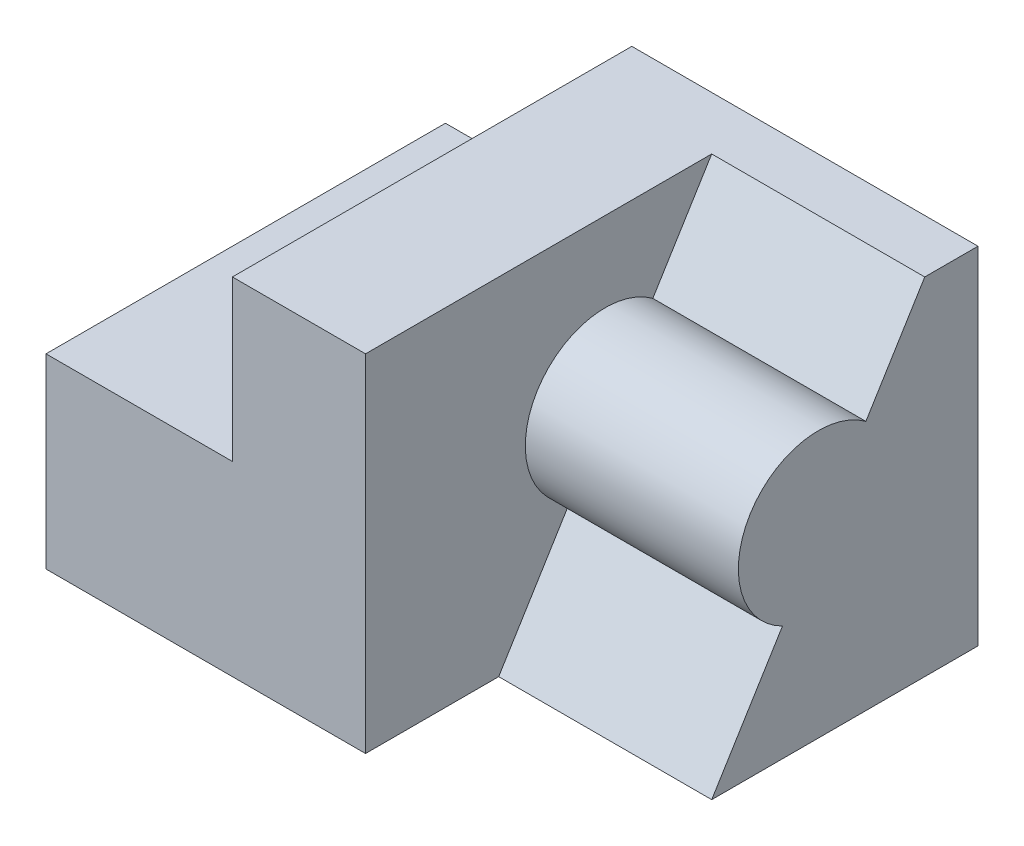
ISO-10303-21;
HEADER;
FILE_DESCRIPTION(('STEP AP214'),'2;1');
FILE_NAME('part.step','',(''),(''),'','','');
FILE_SCHEMA(('AUTOMOTIVE_DESIGN { 1 0 10303 214 1 1 1 1 }'));
ENDSEC;
DATA;
#1=APPLICATION_CONTEXT('core data for automotive mechanical design processes');
#2=APPLICATION_PROTOCOL_DEFINITION('international standard','automotive_design',2000,#1);
#3=PRODUCT_CONTEXT('',#1,'mechanical');
#4=PRODUCT('Part','Part','',(#3));
#5=PRODUCT_RELATED_PRODUCT_CATEGORY('part','',(#4));
#6=PRODUCT_DEFINITION_FORMATION('','',#4);
#7=PRODUCT_DEFINITION_CONTEXT('part definition',#1,'design');
#8=PRODUCT_DEFINITION('design','',#6,#7);
#9=PRODUCT_DEFINITION_SHAPE('','',#8);
#10=(LENGTH_UNIT() NAMED_UNIT(*) SI_UNIT(.MILLI.,.METRE.));
#11=(NAMED_UNIT(*) PLANE_ANGLE_UNIT() SI_UNIT($,.RADIAN.));
#12=(NAMED_UNIT(*) SI_UNIT($,.STERADIAN.) SOLID_ANGLE_UNIT());
#13=UNCERTAINTY_MEASURE_WITH_UNIT(LENGTH_MEASURE(1.E-05),#10,'distance_accuracy_value','');
#14=(GEOMETRIC_REPRESENTATION_CONTEXT(3) GLOBAL_UNCERTAINTY_ASSIGNED_CONTEXT((#13)) GLOBAL_UNIT_ASSIGNED_CONTEXT((#10,
#11,#12)) REPRESENTATION_CONTEXT('',''));
#15=CARTESIAN_POINT('',(0.,0.,0.));
#16=DIRECTION('',(0.,0.,1.));
#17=DIRECTION('',(1.,0.,0.));
#18=AXIS2_PLACEMENT_3D('',#15,#16,#17);
#19=CARTESIAN_POINT('',(0.,65.,0.));
#20=DIRECTION('',(0.,0.,-1.));
#21=DIRECTION('',(-1.,0.,0.));
#22=AXIS2_PLACEMENT_3D('',#19,#20,#21);
#23=PLANE('',#22);
#24=DIRECTION('',(0.,-1.,0.));
#25=VECTOR('',#24,1.);
#26=CARTESIAN_POINT('',(60.,65.,0.));
#27=LINE('',#26,#25);
#28=CARTESIAN_POINT('',(60.,65.,0.));
#29=VERTEX_POINT('',#28);
#30=CARTESIAN_POINT('',(60.,0.,0.));
#31=VERTEX_POINT('',#30);
#32=EDGE_CURVE('E54',#29,#31,#27,.T.);
#33=ORIENTED_EDGE('',*,*,#32,.F.);
#34=DIRECTION('',(1.,0.,0.));
#35=VECTOR('',#34,1.);
#36=CARTESIAN_POINT('',(0.,65.,0.));
#37=LINE('',#36,#35);
#38=CARTESIAN_POINT('',(35.,65.,0.));
#39=VERTEX_POINT('',#38);
#40=EDGE_CURVE('E162',#39,#29,#37,.T.);
#41=ORIENTED_EDGE('',*,*,#40,.F.);
#42=DIRECTION('',(0.,1.,0.));
#43=VECTOR('',#42,1.);
#44=CARTESIAN_POINT('',(35.,35.,0.));
#45=LINE('',#44,#43);
#46=CARTESIAN_POINT('',(35.,35.,0.));
#47=VERTEX_POINT('',#46);
#48=EDGE_CURVE('E62',#47,#39,#45,.T.);
#49=ORIENTED_EDGE('',*,*,#48,.F.);
#50=DIRECTION('',(1.,0.,0.));
#51=VECTOR('',#50,1.);
#52=CARTESIAN_POINT('',(0.,35.,0.));
#53=LINE('',#52,#51);
#54=CARTESIAN_POINT('',(0.,35.,0.));
#55=VERTEX_POINT('',#54);
#56=EDGE_CURVE('E146',#55,#47,#53,.T.);
#57=ORIENTED_EDGE('',*,*,#56,.F.);
#58=DIRECTION('',(0.,-1.,0.));
#59=VECTOR('',#58,1.);
#60=CARTESIAN_POINT('',(0.,65.,0.));
#61=LINE('',#60,#59);
#62=CARTESIAN_POINT('',(0.,0.,0.));
#63=VERTEX_POINT('',#62);
#64=EDGE_CURVE('E11',#55,#63,#61,.T.);
#65=ORIENTED_EDGE('',*,*,#64,.T.);
#66=DIRECTION('',(1.,0.,0.));
#67=VECTOR('',#66,1.);
#68=CARTESIAN_POINT('',(0.,0.,0.));
#69=LINE('',#68,#67);
#70=EDGE_CURVE('E174',#63,#31,#69,.T.);
#71=ORIENTED_EDGE('',*,*,#70,.T.);
#72=EDGE_LOOP('',(#33,#41,#49,#57,#65,#71));
#73=FACE_BOUND('',#72,.T.);
#74=ADVANCED_FACE('F39',(#73),#23,.F.);
#75=CARTESIAN_POINT('',(0.,65.,0.));
#76=DIRECTION('',(1.,0.,0.));
#77=DIRECTION('',(0.,0.,-1.));
#78=AXIS2_PLACEMENT_3D('',#75,#76,#77);
#79=PLANE('',#78);
#80=ORIENTED_EDGE('',*,*,#64,.F.);
#81=DIRECTION('',(0.,0.,1.));
#82=VECTOR('',#81,1.);
#83=CARTESIAN_POINT('',(0.,35.,0.));
#84=LINE('',#83,#82);
#85=CARTESIAN_POINT('',(0.,35.,-75.));
#86=VERTEX_POINT('',#85);
#87=EDGE_CURVE('E144',#86,#55,#84,.T.);
#88=ORIENTED_EDGE('',*,*,#87,.F.);
#89=DIRECTION('',(0.,-1.,0.));
#90=VECTOR('',#89,1.);
#91=CARTESIAN_POINT('',(0.,65.,-75.));
#92=LINE('',#91,#90);
#93=CARTESIAN_POINT('',(0.,0.,-75.));
#94=VERTEX_POINT('',#93);
#95=EDGE_CURVE('E171',#86,#94,#92,.T.);
#96=ORIENTED_EDGE('',*,*,#95,.T.);
#97=DIRECTION('',(0.,0.,1.));
#98=VECTOR('',#97,1.);
#99=CARTESIAN_POINT('',(0.,0.,0.));
#100=LINE('',#99,#98);
#101=EDGE_CURVE('E160',#94,#63,#100,.T.);
#102=ORIENTED_EDGE('',*,*,#101,.T.);
#103=EDGE_LOOP('',(#80,#88,#96,#102));
#104=FACE_BOUND('',#103,.T.);
#105=ADVANCED_FACE('F41',(#104),#79,.F.);
#106=CARTESIAN_POINT('',(100.,65.,0.));
#107=DIRECTION('',(-1.,0.,0.));
#108=DIRECTION('',(0.,0.,1.));
#109=AXIS2_PLACEMENT_3D('',#106,#107,#108);
#110=PLANE('',#109);
#111=DIRECTION('',(0.,0.,-1.));
#112=VECTOR('',#111,1.);
#113=CARTESIAN_POINT('',(100.,65.,0.));
#114=LINE('',#113,#112);
#115=CARTESIAN_POINT('',(100.,65.,-65.));
#116=VERTEX_POINT('',#115);
#117=CARTESIAN_POINT('',(100.,65.,-75.));
#118=VERTEX_POINT('',#117);
#119=EDGE_CURVE('E165',#116,#118,#114,.T.);
#120=ORIENTED_EDGE('',*,*,#119,.F.);
#121=DIRECTION('',(0.,0.851658316704544,-0.524097425664335));
#122=VECTOR('',#121,1.);
#123=CARTESIAN_POINT('',(100.,47.0393503402096,-53.947292517052));
#124=LINE('',#123,#122);
#125=CARTESIAN_POINT('',(100.,47.0393503402096,-53.947292517052));
#126=VERTEX_POINT('',#125);
#127=EDGE_CURVE('E131',#126,#116,#124,.T.);
#128=ORIENTED_EDGE('',*,*,#127,.F.);
#129=CARTESIAN_POINT('',(100.,35.,-45.));
#130=DIRECTION('',(-1.,0.,0.));
#131=DIRECTION('',(0.,0.,-1.));
#132=AXIS2_PLACEMENT_3D('',#129,#130,#131);
#133=CIRCLE('',#132,15.);
#134=CARTESIAN_POINT('',(100.,21.5872591018505,-38.2844671396003));
#135=VERTEX_POINT('',#134);
#136=EDGE_CURVE('E330',#135,#126,#133,.T.);
#137=ORIENTED_EDGE('',*,*,#136,.F.);
#138=DIRECTION('',(0.,0.851658316704544,-0.524097425664335));
#139=VECTOR('',#138,1.);
#140=CARTESIAN_POINT('',(100.,0.,-25.));
#141=LINE('',#140,#139);
#142=CARTESIAN_POINT('',(100.,0.,-25.));
#143=VERTEX_POINT('',#142);
#144=EDGE_CURVE('E335',#143,#135,#141,.T.);
#145=ORIENTED_EDGE('',*,*,#144,.F.);
#146=DIRECTION('',(0.,0.,-1.));
#147=VECTOR('',#146,1.);
#148=CARTESIAN_POINT('',(100.,0.,0.));
#149=LINE('',#148,#147);
#150=CARTESIAN_POINT('',(100.,0.,-75.));
#151=VERTEX_POINT('',#150);
#152=EDGE_CURVE('E136',#143,#151,#149,.T.);
#153=ORIENTED_EDGE('',*,*,#152,.T.);
#154=DIRECTION('',(0.,-1.,0.));
#155=VECTOR('',#154,1.);
#156=CARTESIAN_POINT('',(100.,65.,-75.));
#157=LINE('',#156,#155);
#158=EDGE_CURVE('E47',#118,#151,#157,.T.);
#159=ORIENTED_EDGE('',*,*,#158,.F.);
#160=EDGE_LOOP('',(#120,#128,#137,#145,#153,#159));
#161=FACE_BOUND('',#160,.T.);
#162=ADVANCED_FACE('F205',(#161),#110,.F.);
#163=CARTESIAN_POINT('',(0.,65.,-75.));
#164=DIRECTION('',(0.,0.,1.));
#165=DIRECTION('',(1.,0.,0.));
#166=AXIS2_PLACEMENT_3D('',#163,#164,#165);
#167=PLANE('',#166);
#168=DIRECTION('',(-1.,0.,0.));
#169=VECTOR('',#168,1.);
#170=CARTESIAN_POINT('',(0.,35.,-75.));
#171=LINE('',#170,#169);
#172=CARTESIAN_POINT('',(35.,35.,-75.));
#173=VERTEX_POINT('',#172);
#174=EDGE_CURVE('E153',#173,#86,#171,.T.);
#175=ORIENTED_EDGE('',*,*,#174,.F.);
#176=DIRECTION('',(0.,1.,0.));
#177=VECTOR('',#176,1.);
#178=CARTESIAN_POINT('',(35.,35.,-75.));
#179=LINE('',#178,#177);
#180=CARTESIAN_POINT('',(35.,65.,-75.));
#181=VERTEX_POINT('',#180);
#182=EDGE_CURVE('E157',#173,#181,#179,.T.);
#183=ORIENTED_EDGE('',*,*,#182,.T.);
#184=DIRECTION('',(-1.,0.,0.));
#185=VECTOR('',#184,1.);
#186=CARTESIAN_POINT('',(0.,65.,-75.));
#187=LINE('',#186,#185);
#188=EDGE_CURVE('E168',#118,#181,#187,.T.);
#189=ORIENTED_EDGE('',*,*,#188,.F.);
#190=ORIENTED_EDGE('',*,*,#158,.T.);
#191=DIRECTION('',(-1.,0.,0.));
#192=VECTOR('',#191,1.);
#193=CARTESIAN_POINT('',(0.,0.,-75.));
#194=LINE('',#193,#192);
#195=EDGE_CURVE('E166',#151,#94,#194,.T.);
#196=ORIENTED_EDGE('',*,*,#195,.T.);
#197=ORIENTED_EDGE('',*,*,#95,.F.);
#198=EDGE_LOOP('',(#175,#183,#189,#190,#196,#197));
#199=FACE_BOUND('',#198,.T.);
#200=ADVANCED_FACE('F184',(#199),#167,.F.);
#201=CARTESIAN_POINT('',(0.,65.,0.));
#202=DIRECTION('',(0.,-1.,0.));
#203=DIRECTION('',(0.,0.,-1.));
#204=AXIS2_PLACEMENT_3D('',#201,#202,#203);
#205=PLANE('',#204);
#206=DIRECTION('',(0.,0.,1.));
#207=VECTOR('',#206,1.);
#208=CARTESIAN_POINT('',(60.,65.,-65.));
#209=LINE('',#208,#207);
#210=CARTESIAN_POINT('',(60.,65.,-65.));
#211=VERTEX_POINT('',#210);
#212=EDGE_CURVE('E140',#211,#29,#209,.T.);
#213=ORIENTED_EDGE('',*,*,#212,.F.);
#214=DIRECTION('',(1.,0.,0.));
#215=VECTOR('',#214,1.);
#216=CARTESIAN_POINT('',(60.,65.,-65.));
#217=LINE('',#216,#215);
#218=EDGE_CURVE('E156',#211,#116,#217,.T.);
#219=ORIENTED_EDGE('',*,*,#218,.T.);
#220=ORIENTED_EDGE('',*,*,#119,.T.);
#221=ORIENTED_EDGE('',*,*,#188,.T.);
#222=DIRECTION('',(0.,0.,-1.));
#223=VECTOR('',#222,1.);
#224=CARTESIAN_POINT('',(35.,65.,0.));
#225=LINE('',#224,#223);
#226=EDGE_CURVE('E147',#39,#181,#225,.T.);
#227=ORIENTED_EDGE('',*,*,#226,.F.);
#228=ORIENTED_EDGE('',*,*,#40,.T.);
#229=EDGE_LOOP('',(#213,#219,#220,#221,#227,#228));
#230=FACE_BOUND('',#229,.T.);
#231=ADVANCED_FACE('F199',(#230),#205,.F.);
#232=CARTESIAN_POINT('',(0.,0.,0.));
#233=DIRECTION('',(0.,-1.,0.));
#234=DIRECTION('',(0.,0.,-1.));
#235=AXIS2_PLACEMENT_3D('',#232,#233,#234);
#236=PLANE('',#235);
#237=DIRECTION('',(1.,0.,0.));
#238=VECTOR('',#237,1.);
#239=CARTESIAN_POINT('',(60.,0.,-25.));
#240=LINE('',#239,#238);
#241=CARTESIAN_POINT('',(60.,0.,-25.));
#242=VERTEX_POINT('',#241);
#243=EDGE_CURVE('E119',#242,#143,#240,.T.);
#244=ORIENTED_EDGE('',*,*,#243,.F.);
#245=DIRECTION('',(0.,0.,-1.));
#246=VECTOR('',#245,1.);
#247=CARTESIAN_POINT('',(60.,0.,0.));
#248=LINE('',#247,#246);
#249=EDGE_CURVE('E125',#31,#242,#248,.T.);
#250=ORIENTED_EDGE('',*,*,#249,.F.);
#251=ORIENTED_EDGE('',*,*,#70,.F.);
#252=ORIENTED_EDGE('',*,*,#101,.F.);
#253=ORIENTED_EDGE('',*,*,#195,.F.);
#254=ORIENTED_EDGE('',*,*,#152,.F.);
#255=EDGE_LOOP('',(#244,#250,#251,#252,#253,#254));
#256=FACE_BOUND('',#255,.T.);
#257=ADVANCED_FACE('F134',(#256),#236,.T.);
#258=CARTESIAN_POINT('',(35.,35.,0.));
#259=DIRECTION('',(1.,0.,0.));
#260=DIRECTION('',(0.,0.,-1.));
#261=AXIS2_PLACEMENT_3D('',#258,#259,#260);
#262=PLANE('',#261);
#263=ORIENTED_EDGE('',*,*,#226,.T.);
#264=ORIENTED_EDGE('',*,*,#182,.F.);
#265=DIRECTION('',(0.,0.,-1.));
#266=VECTOR('',#265,1.);
#267=CARTESIAN_POINT('',(35.,35.,0.));
#268=LINE('',#267,#266);
#269=EDGE_CURVE('E150',#47,#173,#268,.T.);
#270=ORIENTED_EDGE('',*,*,#269,.F.);
#271=ORIENTED_EDGE('',*,*,#48,.T.);
#272=EDGE_LOOP('',(#263,#264,#270,#271));
#273=FACE_BOUND('',#272,.T.);
#274=ADVANCED_FACE('F195',(#273),#262,.F.);
#275=CARTESIAN_POINT('',(0.,35.,0.));
#276=DIRECTION('',(0.,-1.,0.));
#277=DIRECTION('',(0.,0.,-1.));
#278=AXIS2_PLACEMENT_3D('',#275,#276,#277);
#279=PLANE('',#278);
#280=ORIENTED_EDGE('',*,*,#87,.T.);
#281=ORIENTED_EDGE('',*,*,#56,.T.);
#282=ORIENTED_EDGE('',*,*,#269,.T.);
#283=ORIENTED_EDGE('',*,*,#174,.T.);
#284=EDGE_LOOP('',(#280,#281,#282,#283));
#285=FACE_BOUND('',#284,.T.);
#286=ADVANCED_FACE('F193',(#285),#279,.F.);
#287=CARTESIAN_POINT('',(60.,47.0393503402096,-53.947292517052));
#288=DIRECTION('',(0.,-0.524097425664335,-0.851658316704544));
#289=DIRECTION('',(0.,0.851658316704544,-0.524097425664335));
#290=AXIS2_PLACEMENT_3D('',#287,#288,#289);
#291=PLANE('',#290);
#292=ORIENTED_EDGE('',*,*,#127,.T.);
#293=ORIENTED_EDGE('',*,*,#218,.F.);
#294=DIRECTION('',(0.,0.851658316704544,-0.524097425664335));
#295=VECTOR('',#294,1.);
#296=CARTESIAN_POINT('',(60.,47.0393503402096,-53.947292517052));
#297=LINE('',#296,#295);
#298=CARTESIAN_POINT('',(60.,47.0393503402096,-53.947292517052));
#299=VERTEX_POINT('',#298);
#300=EDGE_CURVE('E338',#299,#211,#297,.T.);
#301=ORIENTED_EDGE('',*,*,#300,.F.);
#302=DIRECTION('',(1.,0.,0.));
#303=VECTOR('',#302,1.);
#304=CARTESIAN_POINT('',(60.,47.0393503402096,-53.947292517052));
#305=LINE('',#304,#303);
#306=EDGE_CURVE('E138',#299,#126,#305,.T.);
#307=ORIENTED_EDGE('',*,*,#306,.T.);
#308=EDGE_LOOP('',(#292,#293,#301,#307));
#309=FACE_BOUND('',#308,.T.);
#310=ADVANCED_FACE('F219',(#309),#291,.F.);
#311=CARTESIAN_POINT('',(60.,35.,-45.));
#312=DIRECTION('',(1.,0.,0.));
#313=DIRECTION('',(0.,0.,-1.));
#314=AXIS2_PLACEMENT_3D('',#311,#312,#313);
#315=CYLINDRICAL_SURFACE('',#314,15.);
#316=ORIENTED_EDGE('',*,*,#136,.T.);
#317=ORIENTED_EDGE('',*,*,#306,.F.);
#318=CARTESIAN_POINT('',(60.,35.,-45.));
#319=DIRECTION('',(-1.,0.,0.));
#320=DIRECTION('',(0.,0.,-1.));
#321=AXIS2_PLACEMENT_3D('',#318,#319,#320);
#322=CIRCLE('',#321,15.);
#323=CARTESIAN_POINT('',(60.,21.5872591018505,-38.2844671396003));
#324=VERTEX_POINT('',#323);
#325=EDGE_CURVE('E124',#324,#299,#322,.T.);
#326=ORIENTED_EDGE('',*,*,#325,.F.);
#327=DIRECTION('',(1.,0.,0.));
#328=VECTOR('',#327,1.);
#329=CARTESIAN_POINT('',(60.,21.5872591018505,-38.2844671396003));
#330=LINE('',#329,#328);
#331=EDGE_CURVE('E121',#324,#135,#330,.T.);
#332=ORIENTED_EDGE('',*,*,#331,.T.);
#333=EDGE_LOOP('',(#316,#317,#326,#332));
#334=FACE_BOUND('',#333,.T.);
#335=ADVANCED_FACE('F222',(#334),#315,.T.);
#336=CARTESIAN_POINT('',(60.,0.,-25.));
#337=DIRECTION('',(0.,-0.524097425664335,-0.851658316704544));
#338=DIRECTION('',(0.,0.851658316704544,-0.524097425664335));
#339=AXIS2_PLACEMENT_3D('',#336,#337,#338);
#340=PLANE('',#339);
#341=ORIENTED_EDGE('',*,*,#144,.T.);
#342=ORIENTED_EDGE('',*,*,#331,.F.);
#343=DIRECTION('',(0.,0.851658316704544,-0.524097425664335));
#344=VECTOR('',#343,1.);
#345=CARTESIAN_POINT('',(60.,0.,-25.));
#346=LINE('',#345,#344);
#347=EDGE_CURVE('E115',#242,#324,#346,.T.);
#348=ORIENTED_EDGE('',*,*,#347,.F.);
#349=ORIENTED_EDGE('',*,*,#243,.T.);
#350=EDGE_LOOP('',(#341,#342,#348,#349));
#351=FACE_BOUND('',#350,.T.);
#352=ADVANCED_FACE('F117',(#351),#340,.F.);
#353=CARTESIAN_POINT('',(60.,35.,-45.));
#354=DIRECTION('',(1.,0.,0.));
#355=DIRECTION('',(0.,0.,-1.));
#356=AXIS2_PLACEMENT_3D('',#353,#354,#355);
#357=PLANE('',#356);
#358=ORIENTED_EDGE('',*,*,#249,.T.);
#359=ORIENTED_EDGE('',*,*,#347,.T.);
#360=ORIENTED_EDGE('',*,*,#325,.T.);
#361=ORIENTED_EDGE('',*,*,#300,.T.);
#362=ORIENTED_EDGE('',*,*,#212,.T.);
#363=ORIENTED_EDGE('',*,*,#32,.T.);
#364=EDGE_LOOP('',(#358,#359,#360,#361,#362,#363));
#365=FACE_BOUND('',#364,.T.);
#366=ADVANCED_FACE('F127',(#365),#357,.T.);
#367=CLOSED_SHELL('',(#74,#105,#162,#200,#231,#257,#274,#286,#310,#335,#352,#366));
#368=MANIFOLD_SOLID_BREP('B2',#367);
#369=ADVANCED_BREP_SHAPE_REPRESENTATION('',(#18,#368),#14);
#370=SHAPE_DEFINITION_REPRESENTATION(#9,#369);
ENDSEC;
END-ISO-10303-21;
